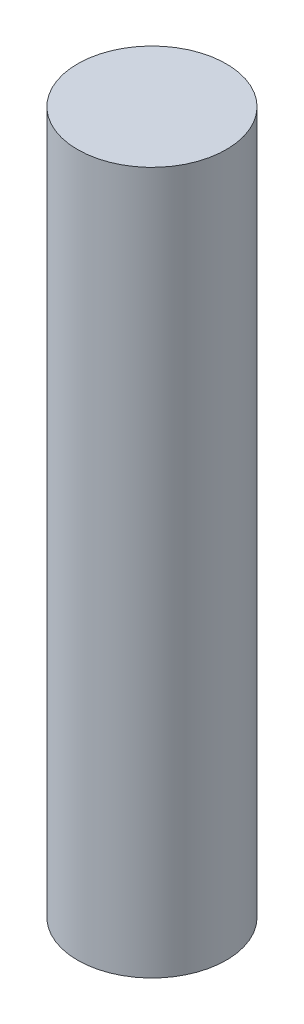
ISO-10303-21;
HEADER;
FILE_DESCRIPTION(('STEP AP214'),'2;1');
FILE_NAME('part.step','',(''),(''),'','','');
FILE_SCHEMA(('AUTOMOTIVE_DESIGN { 1 0 10303 214 1 1 1 1 }'));
ENDSEC;
DATA;
#1=APPLICATION_CONTEXT('core data for automotive mechanical design processes');
#2=APPLICATION_PROTOCOL_DEFINITION('international standard','automotive_design',2000,#1);
#3=PRODUCT_CONTEXT('',#1,'mechanical');
#4=PRODUCT('Part','Part','',(#3));
#5=PRODUCT_RELATED_PRODUCT_CATEGORY('part','',(#4));
#6=PRODUCT_DEFINITION_FORMATION('','',#4);
#7=PRODUCT_DEFINITION_CONTEXT('part definition',#1,'design');
#8=PRODUCT_DEFINITION('design','',#6,#7);
#9=PRODUCT_DEFINITION_SHAPE('','',#8);
#10=(LENGTH_UNIT() NAMED_UNIT(*) SI_UNIT(.MILLI.,.METRE.));
#11=(NAMED_UNIT(*) PLANE_ANGLE_UNIT() SI_UNIT($,.RADIAN.));
#12=(NAMED_UNIT(*) SI_UNIT($,.STERADIAN.) SOLID_ANGLE_UNIT());
#13=UNCERTAINTY_MEASURE_WITH_UNIT(LENGTH_MEASURE(1.E-05),#10,'distance_accuracy_value','');
#14=(GEOMETRIC_REPRESENTATION_CONTEXT(3) GLOBAL_UNCERTAINTY_ASSIGNED_CONTEXT((#13)) GLOBAL_UNIT_ASSIGNED_CONTEXT((#10,
#11,#12)) REPRESENTATION_CONTEXT('',''));
#15=CARTESIAN_POINT('',(0.,0.,0.));
#16=DIRECTION('',(0.,0.,1.));
#17=DIRECTION('',(1.,0.,0.));
#18=AXIS2_PLACEMENT_3D('',#15,#16,#17);
#19=CARTESIAN_POINT('',(0.,8636.,0.));
#20=DIRECTION('',(0.,-1.,0.));
#21=DIRECTION('',(0.,0.,-1.));
#22=AXIS2_PLACEMENT_3D('',#19,#20,#21);
#23=CYLINDRICAL_SURFACE('',#22,914.4);
#24=CARTESIAN_POINT('',(0.,8636.,0.));
#25=DIRECTION('',(0.,1.,0.));
#26=DIRECTION('',(0.,0.,1.));
#27=AXIS2_PLACEMENT_3D('',#24,#25,#26);
#28=CIRCLE('',#27,914.4);
#29=CARTESIAN_POINT('',(0.,8636.,914.4));
#30=VERTEX_POINT('',#29);
#31=EDGE_CURVE('E10',#30,#30,#28,.T.);
#32=ORIENTED_EDGE('',*,*,#31,.F.);
#33=EDGE_LOOP('',(#32));
#34=FACE_BOUND('',#33,.T.);
#35=CARTESIAN_POINT('',(0.,0.,0.));
#36=DIRECTION('',(0.,1.,0.));
#37=DIRECTION('',(0.,0.,1.));
#38=AXIS2_PLACEMENT_3D('',#35,#36,#37);
#39=CIRCLE('',#38,914.4);
#40=CARTESIAN_POINT('',(0.,0.,914.4));
#41=VERTEX_POINT('',#40);
#42=EDGE_CURVE('E40',#41,#41,#39,.T.);
#43=ORIENTED_EDGE('',*,*,#42,.T.);
#44=EDGE_LOOP('',(#43));
#45=FACE_BOUND('',#44,.T.);
#46=ADVANCED_FACE('F37',(#34,#45),#23,.T.);
#47=CARTESIAN_POINT('',(0.,8636.,0.));
#48=DIRECTION('',(0.,1.,0.));
#49=DIRECTION('',(0.,0.,1.));
#50=AXIS2_PLACEMENT_3D('',#47,#48,#49);
#51=PLANE('',#50);
#52=ORIENTED_EDGE('',*,*,#31,.T.);
#53=EDGE_LOOP('',(#52));
#54=FACE_BOUND('',#53,.T.);
#55=ADVANCED_FACE('F54',(#54),#51,.T.);
#56=CARTESIAN_POINT('',(0.,0.,0.));
#57=DIRECTION('',(0.,1.,0.));
#58=DIRECTION('',(0.,0.,1.));
#59=AXIS2_PLACEMENT_3D('',#56,#57,#58);
#60=PLANE('',#59);
#61=ORIENTED_EDGE('',*,*,#42,.F.);
#62=EDGE_LOOP('',(#61));
#63=FACE_BOUND('',#62,.T.);
#64=ADVANCED_FACE('F52',(#63),#60,.F.);
#65=CLOSED_SHELL('',(#46,#55,#64));
#66=MANIFOLD_SOLID_BREP('B2',#65);
#67=ADVANCED_BREP_SHAPE_REPRESENTATION('',(#18,#66),#14);
#68=SHAPE_DEFINITION_REPRESENTATION(#9,#67);
ENDSEC;
END-ISO-10303-21;
